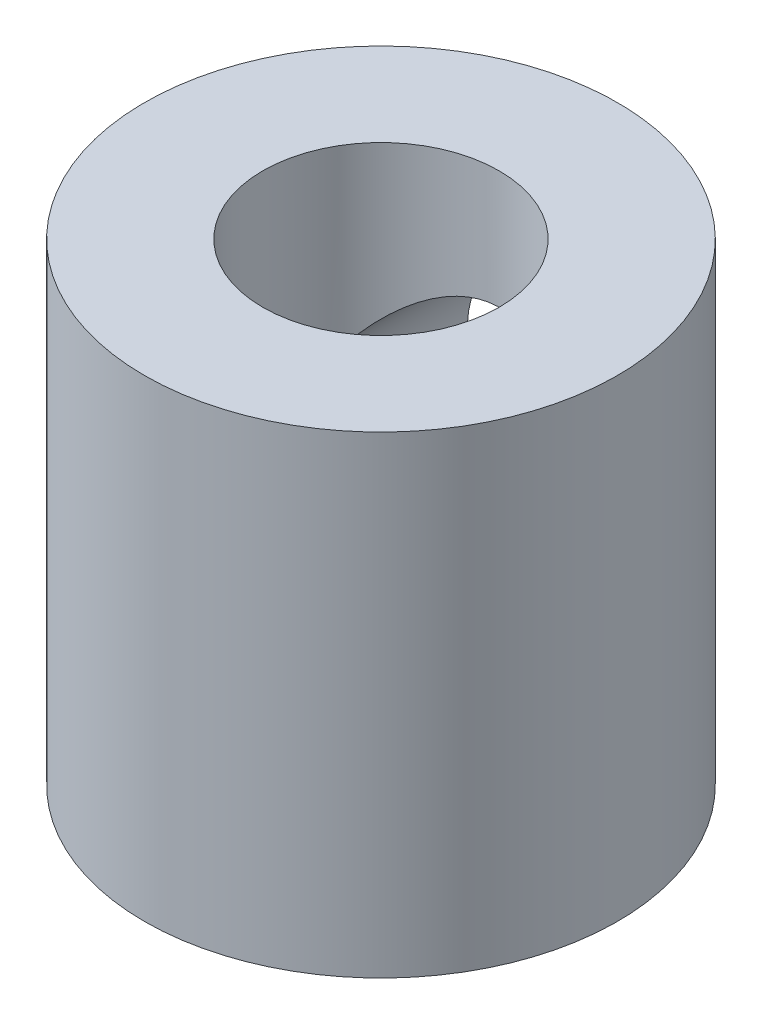
ISO-10303-21;
HEADER;
FILE_DESCRIPTION(('STEP AP214'),'2;1');
FILE_NAME('part.step','',(''),(''),'','','');
FILE_SCHEMA(('AUTOMOTIVE_DESIGN { 1 0 10303 214 1 1 1 1 }'));
ENDSEC;
DATA;
#1=APPLICATION_CONTEXT('core data for automotive mechanical design processes');
#2=APPLICATION_PROTOCOL_DEFINITION('international standard','automotive_design',2000,#1);
#3=PRODUCT_CONTEXT('',#1,'mechanical');
#4=PRODUCT('Part','Part','',(#3));
#5=PRODUCT_RELATED_PRODUCT_CATEGORY('part','',(#4));
#6=PRODUCT_DEFINITION_FORMATION('','',#4);
#7=PRODUCT_DEFINITION_CONTEXT('part definition',#1,'design');
#8=PRODUCT_DEFINITION('design','',#6,#7);
#9=PRODUCT_DEFINITION_SHAPE('','',#8);
#10=(LENGTH_UNIT() NAMED_UNIT(*) SI_UNIT(.MILLI.,.METRE.));
#11=(NAMED_UNIT(*) PLANE_ANGLE_UNIT() SI_UNIT($,.RADIAN.));
#12=(NAMED_UNIT(*) SI_UNIT($,.STERADIAN.) SOLID_ANGLE_UNIT());
#13=UNCERTAINTY_MEASURE_WITH_UNIT(LENGTH_MEASURE(1.E-05),#10,'distance_accuracy_value','');
#14=(GEOMETRIC_REPRESENTATION_CONTEXT(3) GLOBAL_UNCERTAINTY_ASSIGNED_CONTEXT((#13)) GLOBAL_UNIT_ASSIGNED_CONTEXT((#10,
#11,#12)) REPRESENTATION_CONTEXT('',''));
#15=CARTESIAN_POINT('',(0.,0.,0.));
#16=DIRECTION('',(0.,0.,1.));
#17=DIRECTION('',(1.,0.,0.));
#18=AXIS2_PLACEMENT_3D('',#15,#16,#17);
#19=CARTESIAN_POINT('',(0.,20.,0.));
#20=DIRECTION('',(0.,1.,0.));
#21=DIRECTION('',(0.,0.,1.));
#22=AXIS2_PLACEMENT_3D('',#19,#20,#21);
#23=PLANE('',#22);
#24=CARTESIAN_POINT('',(0.,20.,0.));
#25=DIRECTION('',(0.,1.,0.));
#26=DIRECTION('',(0.,0.,1.));
#27=AXIS2_PLACEMENT_3D('',#24,#25,#26);
#28=CIRCLE('',#27,10.);
#29=CARTESIAN_POINT('',(0.,20.,10.));
#30=VERTEX_POINT('',#29);
#31=EDGE_CURVE('E49',#30,#30,#28,.T.);
#32=ORIENTED_EDGE('',*,*,#31,.T.);
#33=EDGE_LOOP('',(#32));
#34=FACE_BOUND('',#33,.T.);
#35=CARTESIAN_POINT('',(0.,20.,0.));
#36=DIRECTION('',(0.,1.,0.));
#37=DIRECTION('',(0.,0.,1.));
#38=AXIS2_PLACEMENT_3D('',#35,#36,#37);
#39=CIRCLE('',#38,5.);
#40=CARTESIAN_POINT('',(0.,20.,5.));
#41=VERTEX_POINT('',#40);
#42=EDGE_CURVE('E57',#41,#41,#39,.T.);
#43=ORIENTED_EDGE('',*,*,#42,.F.);
#44=EDGE_LOOP('',(#43));
#45=FACE_BOUND('',#44,.T.);
#46=ADVANCED_FACE('F31',(#34,#45),#23,.T.);
#47=CARTESIAN_POINT('',(0.,0.,0.));
#48=DIRECTION('',(0.,1.,0.));
#49=DIRECTION('',(0.,0.,1.));
#50=AXIS2_PLACEMENT_3D('',#47,#48,#49);
#51=PLANE('',#50);
#52=CARTESIAN_POINT('',(0.,0.,0.));
#53=DIRECTION('',(0.,1.,0.));
#54=DIRECTION('',(0.,0.,1.));
#55=AXIS2_PLACEMENT_3D('',#52,#53,#54);
#56=CIRCLE('',#55,10.);
#57=CARTESIAN_POINT('',(0.,0.,10.));
#58=VERTEX_POINT('',#57);
#59=EDGE_CURVE('E64',#58,#58,#56,.T.);
#60=ORIENTED_EDGE('',*,*,#59,.F.);
#61=EDGE_LOOP('',(#60));
#62=FACE_BOUND('',#61,.T.);
#63=CARTESIAN_POINT('',(0.,0.,0.));
#64=DIRECTION('',(0.,1.,0.));
#65=DIRECTION('',(0.,0.,1.));
#66=AXIS2_PLACEMENT_3D('',#63,#64,#65);
#67=CIRCLE('',#66,5.);
#68=CARTESIAN_POINT('',(0.,0.,5.));
#69=VERTEX_POINT('',#68);
#70=EDGE_CURVE('E60',#69,#69,#67,.T.);
#71=ORIENTED_EDGE('',*,*,#70,.T.);
#72=EDGE_LOOP('',(#71));
#73=FACE_BOUND('',#72,.T.);
#74=ADVANCED_FACE('F75',(#62,#73),#51,.F.);
#75=CARTESIAN_POINT('',(0.,20.,0.));
#76=DIRECTION('',(0.,-1.,0.));
#77=DIRECTION('',(0.,0.,-1.));
#78=AXIS2_PLACEMENT_3D('',#75,#76,#77);
#79=CYLINDRICAL_SURFACE('',#78,10.);
#80=CARTESIAN_POINT('',(0.,15.,-10.));
#81=CARTESIAN_POINT('',(-0.131488890078729,14.999999567784,-9.99999960171885));
#82=CARTESIAN_POINT('',(-0.262986970217152,14.9948072247149,-9.99740053121284));
#83=CARTESIAN_POINT('',(-0.525014586348056,14.974097105888,-9.98706977835168));
#84=CARTESIAN_POINT('',(-0.655543676003295,14.958574838236,-9.97933586314932));
#85=CARTESIAN_POINT('',(-0.914783203431133,14.9173592205227,-9.95892066969002));
#86=CARTESIAN_POINT('',(-1.04349077535257,14.8916513655938,-9.94623233642882));
#87=CARTESIAN_POINT('',(-1.29802636754293,14.8303493274365,-9.91622716576671));
#88=CARTESIAN_POINT('',(-1.42385318781692,14.7947511025944,-9.89890843630384));
#89=CARTESIAN_POINT('',(-1.67121386584967,14.7142215175487,-9.86015430154804));
#90=CARTESIAN_POINT('',(-1.79276399094562,14.669331351452,-9.83873709670758));
#91=CARTESIAN_POINT('',(-2.0314444775119,14.5705512021931,-9.79224427489325));
#92=CARTESIAN_POINT('',(-2.14857315511666,14.5166578318066,-9.7671672814684));
#93=CARTESIAN_POINT('',(-2.49222561412914,14.342200371061,-9.68730860488736));
#94=CARTESIAN_POINT('',(-2.71128846115304,14.2087692267599,-9.62785460216171));
#95=CARTESIAN_POINT('',(-3.13758045755124,13.9023947187555,-9.49780663424161));
#96=CARTESIAN_POINT('',(-3.34329192972867,13.7275493097203,-9.42675632671347));
#97=CARTESIAN_POINT('',(-3.72388133818108,13.3474109117168,-9.28300214475254));
#98=CARTESIAN_POINT('',(-3.89873577832563,13.1420949380162,-9.21029705743543));
#99=CARTESIAN_POINT('',(-4.22628385620054,12.6875248525357,-9.06493867332993));
#100=CARTESIAN_POINT('',(-4.37620734766694,12.4360981086825,-8.99272664170302));
#101=CARTESIAN_POINT('',(-4.56723365243868,12.0400819556324,-8.89637417546677));
#102=CARTESIAN_POINT('',(-4.62527981130998,11.9048817094397,-8.86624279684719));
#103=CARTESIAN_POINT('',(-4.72948843578257,11.6289987482259,-8.81109611627222));
#104=CARTESIAN_POINT('',(-4.77565793744269,11.4883193363608,-8.78607778701963));
#105=CARTESIAN_POINT('',(-4.8531380584616,11.211007245844,-8.74350562362059));
#106=CARTESIAN_POINT('',(-4.88516762296958,11.0746295200221,-8.72559704108876));
#107=CARTESIAN_POINT('',(-4.93772573892406,10.7990743025204,-8.69596333711106));
#108=CARTESIAN_POINT('',(-4.95826039236648,10.6598983369939,-8.68423493515241));
#109=CARTESIAN_POINT('',(-4.98752398958936,10.3799925388888,-8.66746161087015));
#110=CARTESIAN_POINT('',(-4.99626004329765,10.2392636936859,-8.66241266349288));
#111=CARTESIAN_POINT('',(-5.00180399494055,9.9574988237104,-8.65921299638945));
#112=CARTESIAN_POINT('',(-4.99861303092504,9.81646282952862,-8.66106161851229));
#113=CARTESIAN_POINT('',(-4.98145803092846,9.55229642712305,-8.67093727173593));
#114=CARTESIAN_POINT('',(-4.96883208371091,9.4290473971898,-8.6781966350113));
#115=CARTESIAN_POINT('',(-4.93454402662215,9.18417878603289,-8.69773906996623));
#116=CARTESIAN_POINT('',(-4.91287907868334,9.06255972897806,-8.71002371946268));
#117=CARTESIAN_POINT('',(-4.86076278292654,8.82180212568724,-8.73921479576949));
#118=CARTESIAN_POINT('',(-4.83031251988904,8.70266327514997,-8.75612065195561));
#119=CARTESIAN_POINT('',(-4.76094319159974,8.46752862304561,-8.79403073984606));
#120=CARTESIAN_POINT('',(-4.72202079856857,8.35153407672393,-8.81503658165343));
#121=CARTESIAN_POINT('',(-4.59108661358502,8.00399312838137,-8.88436032421637));
#122=CARTESIAN_POINT('',(-4.48608785825887,7.77830664396215,-8.93828791833521));
#123=CARTESIAN_POINT('',(-4.24519591002764,7.34678988177715,-9.05517433078602));
#124=CARTESIAN_POINT('',(-4.10928884013355,7.14096858224079,-9.11813720101033));
#125=CARTESIAN_POINT('',(-3.79034422310329,6.72741147179621,-9.25565455759079));
#126=CARTESIAN_POINT('',(-3.60351571642877,6.5227419922927,-9.3306665420313));
#127=CARTESIAN_POINT('',(-3.19773444843253,6.14629653431128,-9.47739013910051));
#128=CARTESIAN_POINT('',(-2.97876642220598,5.97453627617878,-9.54910016205802));
#129=CARTESIAN_POINT('',(-2.62430600098782,5.74155910288681,-9.65034506582222));
#130=CARTESIAN_POINT('',(-2.4987100233616,5.66664790485449,-9.68370380274256));
#131=CARTESIAN_POINT('',(-2.24071060142561,5.52779179702757,-9.74663052718473));
#132=CARTESIAN_POINT('',(-2.1083100575541,5.46384226440885,-9.77620011135783));
#133=CARTESIAN_POINT('',(-1.83762803314804,5.34760112461661,-9.83067553510546));
#134=CARTESIAN_POINT('',(-1.69934894682179,5.29530482447521,-9.85558325144946));
#135=CARTESIAN_POINT('',(-1.41791187896084,5.20297507092004,-9.89999026457503));
#136=CARTESIAN_POINT('',(-1.27475446078988,5.16294020681785,-9.91949018350379));
#137=CARTESIAN_POINT('',(-0.996798015430415,5.09846643649698,-9.95109597328192));
#138=CARTESIAN_POINT('',(-0.8622886740298,5.07301048459756,-9.96368046334326));
#139=CARTESIAN_POINT('',(-0.591248360012469,5.0331919587764,-9.98343035732268));
#140=CARTESIAN_POINT('',(-0.454717567193955,5.01882840420991,-9.99059624028198));
#141=CARTESIAN_POINT('',(-0.18081070935965,5.00138683796594,-9.99930380487356));
#142=CARTESIAN_POINT('',(-0.0434349881359024,4.99830450573308,-10.000847639673));
#143=CARTESIAN_POINT('',(0.231047608581548,5.00345557391875,-9.99827237859039));
#144=CARTESIAN_POINT('',(0.368154495704337,5.01168847354931,-9.99415353332645));
#145=CARTESIAN_POINT('',(0.630324023952243,5.03827867384104,-9.98090973082445));
#146=CARTESIAN_POINT('',(0.755493751243217,5.05579837759338,-9.97219922243105));
#147=CARTESIAN_POINT('',(1.00380426086804,5.10017447357061,-9.95027227352716));
#148=CARTESIAN_POINT('',(1.12694438760008,5.12703382309324,-9.93705440583578));
#149=CARTESIAN_POINT('',(1.37032307172125,5.18980268336251,-9.90642450404115));
#150=CARTESIAN_POINT('',(1.49056250470176,5.22570942467813,-9.88901375346268));
#151=CARTESIAN_POINT('',(1.72747946867538,5.30622816132318,-9.85039368148873));
#152=CARTESIAN_POINT('',(1.84415561535681,5.35084349135266,-9.8291829052407));
#153=CARTESIAN_POINT('',(2.19430354472275,5.49994780685029,-9.75922876416582));
#154=CARTESIAN_POINT('',(2.42111320848944,5.61794074178507,-9.70504904478179));
#155=CARTESIAN_POINT('',(2.8523456015808,5.8855521932197,-9.58719375745592));
#156=CARTESIAN_POINT('',(3.05675873773467,6.03518418199231,-9.52351414776381));
#157=CARTESIAN_POINT('',(3.45882132675025,6.37878729103662,-9.38541505392104));
#158=CARTESIAN_POINT('',(3.65383533419946,6.57566959175243,-9.31055499361995));
#159=CARTESIAN_POINT('',(4.00930667677967,6.99967053713395,-9.16310881759143));
#160=CARTESIAN_POINT('',(4.16974010650665,7.22680992399832,-9.09052430437332));
#161=CARTESIAN_POINT('',(4.38466016919211,7.59249056622925,-8.98785260582619));
#162=CARTESIAN_POINT('',(4.4532676226712,7.72185087454347,-8.95395955241383));
#163=CARTESIAN_POINT('',(4.57918112262684,7.98689410077896,-8.89022352415079));
#164=CARTESIAN_POINT('',(4.63649228788887,8.12257412037592,-8.86037871680369));
#165=CARTESIAN_POINT('',(4.73913999074899,8.39927703532523,-8.80590327365628));
#166=CARTESIAN_POINT('',(4.78448631442401,8.54029545575004,-8.78126837994729));
#167=CARTESIAN_POINT('',(4.86265004333096,8.82669104282481,-8.73822819098158));
#168=CARTESIAN_POINT('',(4.89546938847111,8.97206753082754,-8.7198219312185));
#169=CARTESIAN_POINT('',(4.94553834792943,9.25176498153527,-8.69151275671387));
#170=CARTESIAN_POINT('',(4.96397997433445,9.38580788311994,-8.6809632703526));
#171=CARTESIAN_POINT('',(4.98993873206133,9.65528524569737,-8.66606824539578));
#172=CARTESIAN_POINT('',(4.99745700797003,9.79071955939521,-8.66172205679783));
#173=CARTESIAN_POINT('',(5.00145477351748,10.0617569250046,-8.65941425656731));
#174=CARTESIAN_POINT('',(4.99793814327599,10.1973599008496,-8.66145040076354));
#175=CARTESIAN_POINT('',(4.97992974203947,10.4675855579479,-8.67181681785816));
#176=CARTESIAN_POINT('',(4.96543842034336,10.6022082791045,-8.68014683308828));
#177=CARTESIAN_POINT('',(4.92759757627216,10.856560202159,-8.70167828744801));
#178=CARTESIAN_POINT('',(4.90522766015001,10.9764825596239,-8.71433770908853));
#179=CARTESIAN_POINT('',(4.85194376743194,11.2138611905675,-8.74411599480516));
#180=CARTESIAN_POINT('',(4.82102714868723,11.331316689334,-8.76123623781642));
#181=CARTESIAN_POINT('',(4.71590306073959,11.6789171151129,-8.81854231868724));
#182=CARTESIAN_POINT('',(4.62929708984156,11.904456094986,-8.86468813771129));
#183=CARTESIAN_POINT('',(4.41907164675021,12.3531603423125,-8.97142890954605));
#184=CARTESIAN_POINT('',(4.29335633682032,12.5751480759893,-9.03278633647389));
#185=CARTESIAN_POINT('',(4.01075421010745,12.9963641095957,-9.16176636495219));
#186=CARTESIAN_POINT('',(3.85385117607733,13.1955804834442,-9.22939221620456));
#187=CARTESIAN_POINT('',(3.49102748964406,13.5907078584707,-9.37311444600789));
#188=CARTESIAN_POINT('',(3.28146736342599,13.7832760187676,-9.44924162905911));
#189=CARTESIAN_POINT('',(2.83072875767415,14.1313344211833,-9.59389514971535));
#190=CARTESIAN_POINT('',(2.58953334336126,14.2868046777436,-9.66241737976037));
#191=CARTESIAN_POINT('',(2.20753881885374,14.4886304145268,-9.7541901337583));
#192=CARTESIAN_POINT('',(2.07625512570271,14.5508670794064,-9.78304209980294));
#193=CARTESIAN_POINT('',(1.80799529933999,14.6639361561204,-9.83614745234555));
#194=CARTESIAN_POINT('',(1.67102200205152,14.7147741705306,-9.8604030970797));
#195=CARTESIAN_POINT('',(1.39269501068688,14.8043454383672,-9.90354484128718));
#196=CARTESIAN_POINT('',(1.25135162347082,14.8431050929877,-9.92244264379385));
#197=CARTESIAN_POINT('',(0.965237205795561,14.9081375962686,-9.95434618112011));
#198=CARTESIAN_POINT('',(0.820468326048376,14.934418072527,-9.96735551489675));
#199=CARTESIAN_POINT('',(0.563041654408164,14.9694745319989,-9.98476387878718));
#200=CARTESIAN_POINT('',(0.450825809730029,14.980911753692,-9.99046741601666));
#201=CARTESIAN_POINT('',(0.225742246050269,14.9961747782501,-9.99808569986015));
#202=CARTESIAN_POINT('',(0.11287450914219,15.0000003710289,-10.000000341898));
#203=CARTESIAN_POINT('',(0.,15.,-10.));
#204=B_SPLINE_CURVE_WITH_KNOTS('',3,(#80,#81,#82,#83,#84,#85,#86,#87,#88,#89,#90,#91,#92,#93,
#94,#95,#96,#97,#98,#99,#100,#101,#102,#103,#104,#105,#106,#107,#108,#109,#110,#111,#112,#113,
#114,#115,#116,#117,#118,#119,#120,#121,#122,#123,#124,#125,#126,#127,#128,#129,#130,#131,#132,
#133,#134,#135,#136,#137,#138,#139,#140,#141,#142,#143,#144,#145,#146,#147,#148,#149,#150,#151,
#152,#153,#154,#155,#156,#157,#158,#159,#160,#161,#162,#163,#164,#165,#166,#167,#168,#169,#170,
#171,#172,#173,#174,#175,#176,#177,#178,#179,#180,#181,#182,#183,#184,#185,#186,#187,#188,#189,
#190,#191,#192,#193,#194,#195,#196,#197,#198,#199,#200,#201,#202,#203),.UNSPECIFIED.,.T.,.F.,(4,
2,2,2,2,2,2,2,2,2,2,2,2,2,2,2,2,2,2,2,2,2,2,2,2,2,2,2,2,2,2,2,2,2,2,2,2,2,2,2,2,2,2,2,2,2,2,2,2,
2,2,2,2,2,2,2,2,2,2,2,2,4),(0.,0.39435529464989,0.788882184037817,1.18397293369035,
1.57922537181693,1.97276168530542,2.36644639154632,3.15295441699266,3.98704440767527,
4.821766802355,5.72122193562246,6.1712535998946,6.62101803579306,7.04410338623952,
7.46696393118359,7.88956954321097,8.31213483216671,8.68401534897463,9.05601271689169,
9.42796417149685,9.80006198990961,10.56083380205,11.3219478566368,12.1795688603196,
13.03759852356,13.4870830845772,13.9363776171859,14.3854908824168,14.8345524573652,
15.2464230691107,15.6582572644723,16.0699337163998,16.4815919489941,16.8612200640511,
17.240968493866,17.6206008225791,18.0003788066131,18.7808755264615,19.5617052624835,
20.4192132572739,21.2773121558255,21.7277011924366,22.1778856687596,22.6277007885002,
23.0774462222894,23.4840267197959,23.8905646113036,24.2969595710184,24.703337894006,
25.0708552370355,25.4384863225851,26.1732662495599,26.9574126491567,27.7419678673239,
28.6218519479817,29.5022089791541,29.9460734671028,30.3897193096444,30.8323885049027,
31.2747867798493,31.6133053554877,31.9518332743451),.UNSPECIFIED.);
#205=CARTESIAN_POINT('',(0.,15.,-10.));
#206=VERTEX_POINT('',#205);
#207=EDGE_CURVE('E62',#206,#206,#204,.T.);
#208=ORIENTED_EDGE('',*,*,#207,.T.);
#209=EDGE_LOOP('',(#208));
#210=FACE_BOUND('',#209,.T.);
#211=ORIENTED_EDGE('',*,*,#31,.F.);
#212=EDGE_LOOP('',(#211));
#213=FACE_BOUND('',#212,.T.);
#214=ORIENTED_EDGE('',*,*,#59,.T.);
#215=EDGE_LOOP('',(#214));
#216=FACE_BOUND('',#215,.T.);
#217=ADVANCED_FACE('F33',(#210,#213,#216),#79,.T.);
#218=CARTESIAN_POINT('',(0.,20.,0.));
#219=DIRECTION('',(0.,-1.,0.));
#220=DIRECTION('',(0.,0.,-1.));
#221=AXIS2_PLACEMENT_3D('',#218,#219,#220);
#222=CYLINDRICAL_SURFACE('',#221,5.);
#223=CARTESIAN_POINT('',(0.,10.,0.));
#224=DIRECTION('',(0.,-0.707106781186547,0.707106781186547));
#225=DIRECTION('',(0.,-0.707106781186547,-0.707106781186547));
#226=AXIS2_PLACEMENT_3D('',#223,#224,#225);
#227=ELLIPSE('',#226,7.07106781186548,5.);
#228=CARTESIAN_POINT('',(-5.,10.,0.));
#229=VERTEX_POINT('',#228);
#230=CARTESIAN_POINT('',(5.,10.,0.));
#231=VERTEX_POINT('',#230);
#232=EDGE_CURVE('E11',#229,#231,#227,.T.);
#233=ORIENTED_EDGE('',*,*,#232,.F.);
#234=CARTESIAN_POINT('',(0.,10.,0.));
#235=DIRECTION('',(0.,-0.707106781186547,-0.707106781186547));
#236=DIRECTION('',(0.,-0.707106781186547,0.707106781186547));
#237=AXIS2_PLACEMENT_3D('',#234,#235,#236);
#238=ELLIPSE('',#237,7.07106781186548,5.);
#239=EDGE_CURVE('E40',#231,#229,#238,.F.);
#240=ORIENTED_EDGE('',*,*,#239,.F.);
#241=EDGE_LOOP('',(#233,#240));
#242=FACE_BOUND('',#241,.T.);
#243=ORIENTED_EDGE('',*,*,#42,.T.);
#244=EDGE_LOOP('',(#243));
#245=FACE_BOUND('',#244,.T.);
#246=ORIENTED_EDGE('',*,*,#70,.F.);
#247=EDGE_LOOP('',(#246));
#248=FACE_BOUND('',#247,.T.);
#249=ADVANCED_FACE('F50',(#242,#245,#248),#222,.F.);
#250=CARTESIAN_POINT('',(0.,10.,-20.));
#251=DIRECTION('',(0.,0.,1.));
#252=DIRECTION('',(1.,0.,0.));
#253=AXIS2_PLACEMENT_3D('',#250,#251,#252);
#254=CYLINDRICAL_SURFACE('',#253,5.);
#255=ORIENTED_EDGE('',*,*,#232,.T.);
#256=ORIENTED_EDGE('',*,*,#239,.T.);
#257=EDGE_LOOP('',(#255,#256));
#258=FACE_BOUND('',#257,.T.);
#259=ORIENTED_EDGE('',*,*,#207,.F.);
#260=EDGE_LOOP('',(#259));
#261=FACE_BOUND('',#260,.T.);
#262=ADVANCED_FACE('F46',(#258,#261),#254,.F.);
#263=CLOSED_SHELL('',(#46,#74,#217,#249,#262));
#264=MANIFOLD_SOLID_BREP('B2',#263);
#265=ADVANCED_BREP_SHAPE_REPRESENTATION('',(#18,#264),#14);
#266=SHAPE_DEFINITION_REPRESENTATION(#9,#265);
ENDSEC;
END-ISO-10303-21;
